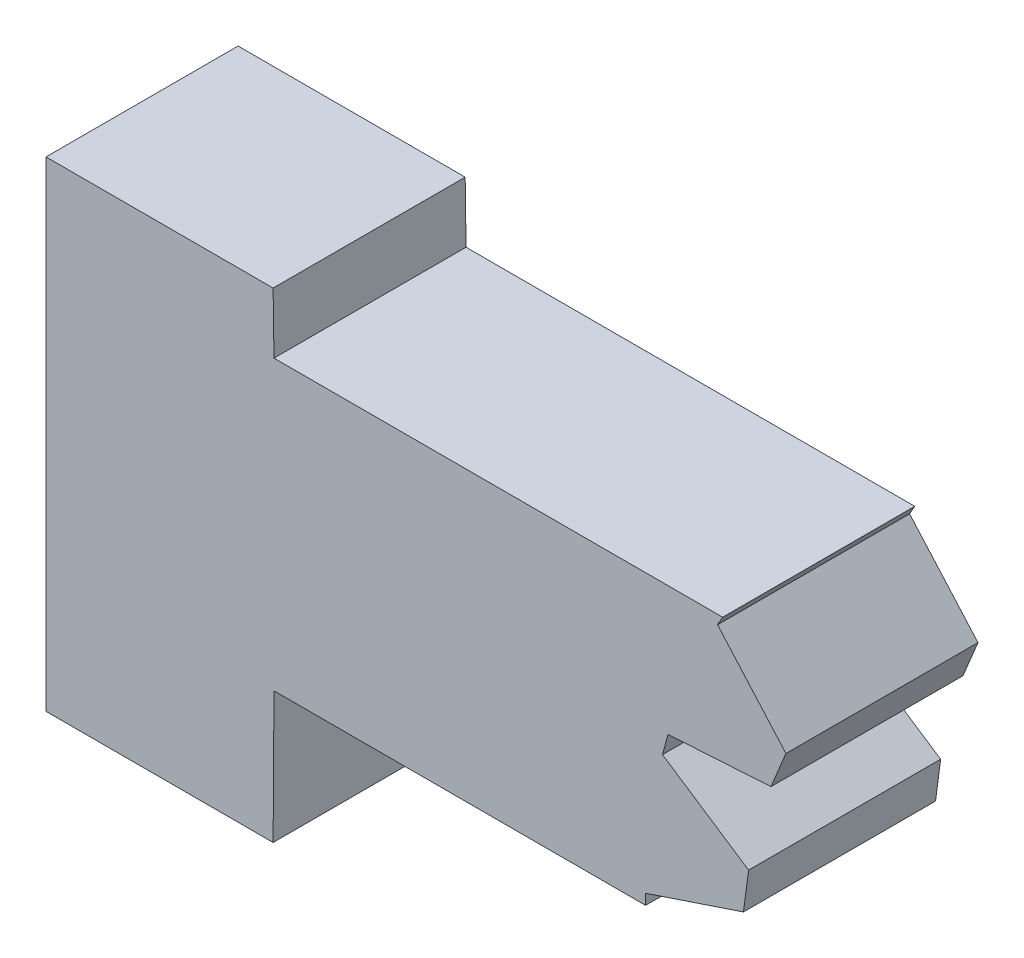
ISO-10303-21;
HEADER;
FILE_DESCRIPTION(('STEP AP214'),'2;1');
FILE_NAME('part.step','',(''),(''),'','','');
FILE_SCHEMA(('AUTOMOTIVE_DESIGN { 1 0 10303 214 1 1 1 1 }'));
ENDSEC;
DATA;
#1=APPLICATION_CONTEXT('core data for automotive mechanical design processes');
#2=APPLICATION_PROTOCOL_DEFINITION('international standard','automotive_design',2000,#1);
#3=PRODUCT_CONTEXT('',#1,'mechanical');
#4=PRODUCT('Part','Part','',(#3));
#5=PRODUCT_RELATED_PRODUCT_CATEGORY('part','',(#4));
#6=PRODUCT_DEFINITION_FORMATION('','',#4);
#7=PRODUCT_DEFINITION_CONTEXT('part definition',#1,'design');
#8=PRODUCT_DEFINITION('design','',#6,#7);
#9=PRODUCT_DEFINITION_SHAPE('','',#8);
#10=(LENGTH_UNIT() NAMED_UNIT(*) SI_UNIT(.MILLI.,.METRE.));
#11=(NAMED_UNIT(*) PLANE_ANGLE_UNIT() SI_UNIT($,.RADIAN.));
#12=(NAMED_UNIT(*) SI_UNIT($,.STERADIAN.) SOLID_ANGLE_UNIT());
#13=UNCERTAINTY_MEASURE_WITH_UNIT(LENGTH_MEASURE(1.E-05),#10,'distance_accuracy_value','');
#14=(GEOMETRIC_REPRESENTATION_CONTEXT(3) GLOBAL_UNCERTAINTY_ASSIGNED_CONTEXT((#13)) GLOBAL_UNIT_ASSIGNED_CONTEXT((#10,
#11,#12)) REPRESENTATION_CONTEXT('',''));
#15=CARTESIAN_POINT('',(0.,0.,0.));
#16=DIRECTION('',(0.,0.,1.));
#17=DIRECTION('',(1.,0.,0.));
#18=AXIS2_PLACEMENT_3D('',#15,#16,#17);
#19=CARTESIAN_POINT('',(13.9854605352733,8.55490384085248,4.));
#20=DIRECTION('',(-0.870533332407199,0.492109456491152,0.));
#21=DIRECTION('',(-0.492109456491152,-0.870533332407199,0.));
#22=AXIS2_PLACEMENT_3D('',#19,#20,#21);
#23=PLANE('',#22);
#24=DIRECTION('',(0.492109456491152,0.870533332407199,0.));
#25=VECTOR('',#24,1.);
#26=CARTESIAN_POINT('',(13.9854605352733,8.55490384085248,0.));
#27=LINE('',#26,#25);
#28=CARTESIAN_POINT('',(13.9854605352733,8.55490384085248,0.));
#29=VERTEX_POINT('',#28);
#30=CARTESIAN_POINT('',(14.0927837049311,8.74475671869166,0.));
#31=VERTEX_POINT('',#30);
#32=EDGE_CURVE('E179',#29,#31,#27,.T.);
#33=ORIENTED_EDGE('',*,*,#32,.T.);
#34=DIRECTION('',(0.,0.,-1.));
#35=VECTOR('',#34,1.);
#36=CARTESIAN_POINT('',(14.0927837049311,8.74475671869166,4.));
#37=LINE('',#36,#35);
#38=CARTESIAN_POINT('',(14.0927837049311,8.74475671869166,4.));
#39=VERTEX_POINT('',#38);
#40=EDGE_CURVE('E11',#39,#31,#37,.T.);
#41=ORIENTED_EDGE('',*,*,#40,.F.);
#42=DIRECTION('',(0.492109456491152,0.870533332407199,0.));
#43=VECTOR('',#42,1.);
#44=CARTESIAN_POINT('',(13.9854605352733,8.55490384085248,4.));
#45=LINE('',#44,#43);
#46=CARTESIAN_POINT('',(13.9854605352733,8.55490384085248,4.));
#47=VERTEX_POINT('',#46);
#48=EDGE_CURVE('E209',#47,#39,#45,.T.);
#49=ORIENTED_EDGE('',*,*,#48,.F.);
#50=DIRECTION('',(0.,0.,-1.));
#51=VECTOR('',#50,1.);
#52=CARTESIAN_POINT('',(13.9854605352733,8.55490384085248,4.));
#53=LINE('',#52,#51);
#54=EDGE_CURVE('E175',#47,#29,#53,.T.);
#55=ORIENTED_EDGE('',*,*,#54,.T.);
#56=EDGE_LOOP('',(#33,#41,#49,#55));
#57=FACE_BOUND('',#56,.T.);
#58=ADVANCED_FACE('F35',(#57),#23,.F.);
#59=CARTESIAN_POINT('',(4.74778370493112,8.74475671869166,4.));
#60=DIRECTION('',(0.,-1.,0.));
#61=DIRECTION('',(0.,0.,-1.));
#62=AXIS2_PLACEMENT_3D('',#59,#60,#61);
#63=PLANE('',#62);
#64=DIRECTION('',(-1.,0.,0.));
#65=VECTOR('',#64,1.);
#66=CARTESIAN_POINT('',(4.74778370493112,8.74475671869166,0.));
#67=LINE('',#66,#65);
#68=CARTESIAN_POINT('',(4.74778370493112,8.74475671869166,0.));
#69=VERTEX_POINT('',#68);
#70=EDGE_CURVE('E182',#31,#69,#67,.T.);
#71=ORIENTED_EDGE('',*,*,#70,.T.);
#72=DIRECTION('',(0.,0.,-1.));
#73=VECTOR('',#72,1.);
#74=CARTESIAN_POINT('',(4.74778370493112,8.74475671869166,4.));
#75=LINE('',#74,#73);
#76=CARTESIAN_POINT('',(4.74778370493112,8.74475671869166,4.));
#77=VERTEX_POINT('',#76);
#78=EDGE_CURVE('E43',#77,#69,#75,.T.);
#79=ORIENTED_EDGE('',*,*,#78,.F.);
#80=DIRECTION('',(-1.,0.,0.));
#81=VECTOR('',#80,1.);
#82=CARTESIAN_POINT('',(4.74778370493112,8.74475671869166,4.));
#83=LINE('',#82,#81);
#84=EDGE_CURVE('E118',#39,#77,#83,.T.);
#85=ORIENTED_EDGE('',*,*,#84,.F.);
#86=ORIENTED_EDGE('',*,*,#40,.T.);
#87=EDGE_LOOP('',(#71,#79,#85,#86));
#88=FACE_BOUND('',#87,.T.);
#89=ADVANCED_FACE('F307',(#88),#63,.F.);
#90=CARTESIAN_POINT('',(4.73,10.,4.));
#91=DIRECTION('',(-0.999899655561117,-0.01416611480819,0.));
#92=DIRECTION('',(0.01416611480819,-0.999899655561117,0.));
#93=AXIS2_PLACEMENT_3D('',#90,#91,#92);
#94=PLANE('',#93);
#95=DIRECTION('',(-0.01416611480819,0.999899655561117,0.));
#96=VECTOR('',#95,1.);
#97=CARTESIAN_POINT('',(4.73,10.,0.));
#98=LINE('',#97,#96);
#99=CARTESIAN_POINT('',(4.73,10.,0.));
#100=VERTEX_POINT('',#99);
#101=EDGE_CURVE('E184',#69,#100,#98,.T.);
#102=ORIENTED_EDGE('',*,*,#101,.T.);
#103=DIRECTION('',(0.,0.,-1.));
#104=VECTOR('',#103,1.);
#105=CARTESIAN_POINT('',(4.73,10.,4.));
#106=LINE('',#105,#104);
#107=CARTESIAN_POINT('',(4.73,10.,4.));
#108=VERTEX_POINT('',#107);
#109=EDGE_CURVE('E240',#108,#100,#106,.T.);
#110=ORIENTED_EDGE('',*,*,#109,.F.);
#111=DIRECTION('',(-0.01416611480819,0.999899655561117,0.));
#112=VECTOR('',#111,1.);
#113=CARTESIAN_POINT('',(4.73,10.,4.));
#114=LINE('',#113,#112);
#115=EDGE_CURVE('E248',#77,#108,#114,.T.);
#116=ORIENTED_EDGE('',*,*,#115,.F.);
#117=ORIENTED_EDGE('',*,*,#78,.T.);
#118=EDGE_LOOP('',(#102,#110,#116,#117));
#119=FACE_BOUND('',#118,.T.);
#120=ADVANCED_FACE('F246',(#119),#94,.F.);
#121=CARTESIAN_POINT('',(4.73,10.,4.));
#122=DIRECTION('',(0.,-1.,0.));
#123=DIRECTION('',(0.,0.,-1.));
#124=AXIS2_PLACEMENT_3D('',#121,#122,#123);
#125=PLANE('',#124);
#126=DIRECTION('',(-1.,0.,0.));
#127=VECTOR('',#126,1.);
#128=CARTESIAN_POINT('',(4.73,10.,0.));
#129=LINE('',#128,#127);
#130=CARTESIAN_POINT('',(0.,10.,0.));
#131=VERTEX_POINT('',#130);
#132=EDGE_CURVE('E186',#100,#131,#129,.T.);
#133=ORIENTED_EDGE('',*,*,#132,.T.);
#134=DIRECTION('',(0.,0.,-1.));
#135=VECTOR('',#134,1.);
#136=CARTESIAN_POINT('',(0.,10.,4.));
#137=LINE('',#136,#135);
#138=CARTESIAN_POINT('',(0.,10.,4.));
#139=VERTEX_POINT('',#138);
#140=EDGE_CURVE('E237',#139,#131,#137,.T.);
#141=ORIENTED_EDGE('',*,*,#140,.F.);
#142=DIRECTION('',(-1.,0.,0.));
#143=VECTOR('',#142,1.);
#144=CARTESIAN_POINT('',(4.73,10.,4.));
#145=LINE('',#144,#143);
#146=EDGE_CURVE('E266',#108,#139,#145,.T.);
#147=ORIENTED_EDGE('',*,*,#146,.F.);
#148=ORIENTED_EDGE('',*,*,#109,.T.);
#149=EDGE_LOOP('',(#133,#141,#147,#148));
#150=FACE_BOUND('',#149,.T.);
#151=ADVANCED_FACE('F257',(#150),#125,.F.);
#152=CARTESIAN_POINT('',(0.,0.,4.));
#153=DIRECTION('',(1.,0.,0.));
#154=DIRECTION('',(0.,0.,-1.));
#155=AXIS2_PLACEMENT_3D('',#152,#153,#154);
#156=PLANE('',#155);
#157=DIRECTION('',(0.,-1.,0.));
#158=VECTOR('',#157,1.);
#159=CARTESIAN_POINT('',(0.,0.,0.));
#160=LINE('',#159,#158);
#161=CARTESIAN_POINT('',(0.,0.,0.));
#162=VERTEX_POINT('',#161);
#163=EDGE_CURVE('E188',#131,#162,#160,.T.);
#164=ORIENTED_EDGE('',*,*,#163,.T.);
#165=DIRECTION('',(0.,0.,-1.));
#166=VECTOR('',#165,1.);
#167=CARTESIAN_POINT('',(0.,0.,4.));
#168=LINE('',#167,#166);
#169=CARTESIAN_POINT('',(0.,0.,4.));
#170=VERTEX_POINT('',#169);
#171=EDGE_CURVE('E234',#170,#162,#168,.T.);
#172=ORIENTED_EDGE('',*,*,#171,.F.);
#173=DIRECTION('',(0.,-1.,0.));
#174=VECTOR('',#173,1.);
#175=CARTESIAN_POINT('',(0.,0.,4.));
#176=LINE('',#175,#174);
#177=EDGE_CURVE('E263',#139,#170,#176,.T.);
#178=ORIENTED_EDGE('',*,*,#177,.F.);
#179=ORIENTED_EDGE('',*,*,#140,.T.);
#180=EDGE_LOOP('',(#164,#172,#178,#179));
#181=FACE_BOUND('',#180,.T.);
#182=ADVANCED_FACE('F261',(#181),#156,.F.);
#183=CARTESIAN_POINT('',(4.73,0.,4.));
#184=DIRECTION('',(0.,1.,0.));
#185=DIRECTION('',(0.,0.,1.));
#186=AXIS2_PLACEMENT_3D('',#183,#184,#185);
#187=PLANE('',#186);
#188=DIRECTION('',(1.,0.,0.));
#189=VECTOR('',#188,1.);
#190=CARTESIAN_POINT('',(4.73,0.,0.));
#191=LINE('',#190,#189);
#192=CARTESIAN_POINT('',(4.73,0.,0.));
#193=VERTEX_POINT('',#192);
#194=EDGE_CURVE('E190',#162,#193,#191,.T.);
#195=ORIENTED_EDGE('',*,*,#194,.T.);
#196=DIRECTION('',(0.,0.,-1.));
#197=VECTOR('',#196,1.);
#198=CARTESIAN_POINT('',(4.73,0.,4.));
#199=LINE('',#198,#197);
#200=CARTESIAN_POINT('',(4.73,0.,4.));
#201=VERTEX_POINT('',#200);
#202=EDGE_CURVE('E231',#201,#193,#199,.T.);
#203=ORIENTED_EDGE('',*,*,#202,.F.);
#204=DIRECTION('',(1.,0.,0.));
#205=VECTOR('',#204,1.);
#206=CARTESIAN_POINT('',(4.73,0.,4.));
#207=LINE('',#206,#205);
#208=EDGE_CURVE('E265',#170,#201,#207,.T.);
#209=ORIENTED_EDGE('',*,*,#208,.F.);
#210=ORIENTED_EDGE('',*,*,#171,.T.);
#211=EDGE_LOOP('',(#195,#203,#209,#210));
#212=FACE_BOUND('',#211,.T.);
#213=ADVANCED_FACE('F320',(#212),#187,.F.);
#214=CARTESIAN_POINT('',(4.74778370493112,2.74476455823996,4.));
#215=DIRECTION('',(-0.999979011054282,0.00647900076402233,0.));
#216=DIRECTION('',(-0.00647900076402233,-0.999979011054282,0.));
#217=AXIS2_PLACEMENT_3D('',#214,#215,#216);
#218=PLANE('',#217);
#219=DIRECTION('',(0.00647900076402233,0.999979011054282,0.));
#220=VECTOR('',#219,1.);
#221=CARTESIAN_POINT('',(4.74778370493112,2.74476455823996,0.));
#222=LINE('',#221,#220);
#223=CARTESIAN_POINT('',(4.74778370493112,2.74476455823996,0.));
#224=VERTEX_POINT('',#223);
#225=EDGE_CURVE('E192',#193,#224,#222,.T.);
#226=ORIENTED_EDGE('',*,*,#225,.T.);
#227=DIRECTION('',(0.,0.,-1.));
#228=VECTOR('',#227,1.);
#229=CARTESIAN_POINT('',(4.74778370493112,2.74476455823996,4.));
#230=LINE('',#229,#228);
#231=CARTESIAN_POINT('',(4.74778370493112,2.74476455823996,4.));
#232=VERTEX_POINT('',#231);
#233=EDGE_CURVE('E228',#232,#224,#230,.T.);
#234=ORIENTED_EDGE('',*,*,#233,.F.);
#235=DIRECTION('',(0.00647900076402233,0.999979011054282,0.));
#236=VECTOR('',#235,1.);
#237=CARTESIAN_POINT('',(4.74778370493112,2.74476455823996,4.));
#238=LINE('',#237,#236);
#239=EDGE_CURVE('E268',#201,#232,#238,.T.);
#240=ORIENTED_EDGE('',*,*,#239,.F.);
#241=ORIENTED_EDGE('',*,*,#202,.T.);
#242=EDGE_LOOP('',(#226,#234,#240,#241));
#243=FACE_BOUND('',#242,.T.);
#244=ADVANCED_FACE('F323',(#243),#218,.F.);
#245=CARTESIAN_POINT('',(4.74778370493112,2.74476455823996,4.));
#246=DIRECTION('',(0.,1.,0.));
#247=DIRECTION('',(0.,0.,1.));
#248=AXIS2_PLACEMENT_3D('',#245,#246,#247);
#249=PLANE('',#248);
#250=DIRECTION('',(1.,0.,0.));
#251=VECTOR('',#250,1.);
#252=CARTESIAN_POINT('',(4.74778370493112,2.74476455823996,0.));
#253=LINE('',#252,#251);
#254=CARTESIAN_POINT('',(12.4870749114308,2.74476455823996,0.));
#255=VERTEX_POINT('',#254);
#256=EDGE_CURVE('E194',#224,#255,#253,.T.);
#257=ORIENTED_EDGE('',*,*,#256,.T.);
#258=DIRECTION('',(0.,0.,-1.));
#259=VECTOR('',#258,1.);
#260=CARTESIAN_POINT('',(12.4870749114308,2.74476455823996,4.));
#261=LINE('',#260,#259);
#262=CARTESIAN_POINT('',(12.4870749114308,2.74476455823996,4.));
#263=VERTEX_POINT('',#262);
#264=EDGE_CURVE('E225',#263,#255,#261,.T.);
#265=ORIENTED_EDGE('',*,*,#264,.F.);
#266=DIRECTION('',(1.,0.,0.));
#267=VECTOR('',#266,1.);
#268=CARTESIAN_POINT('',(4.74778370493112,2.74476455823996,4.));
#269=LINE('',#268,#267);
#270=EDGE_CURVE('E274',#232,#263,#269,.T.);
#271=ORIENTED_EDGE('',*,*,#270,.F.);
#272=ORIENTED_EDGE('',*,*,#233,.T.);
#273=EDGE_LOOP('',(#257,#265,#271,#272));
#274=FACE_BOUND('',#273,.T.);
#275=ADVANCED_FACE('F327',(#274),#249,.F.);
#276=CARTESIAN_POINT('',(12.4870749114308,2.74476455823996,4.));
#277=DIRECTION('',(-1.,0.,0.));
#278=DIRECTION('',(0.,0.,1.));
#279=AXIS2_PLACEMENT_3D('',#276,#277,#278);
#280=PLANE('',#279);
#281=DIRECTION('',(0.,1.,0.));
#282=VECTOR('',#281,1.);
#283=CARTESIAN_POINT('',(12.4870749114308,2.74476455823996,0.));
#284=LINE('',#283,#282);
#285=CARTESIAN_POINT('',(12.4870749114308,2.96285256334162,0.));
#286=VERTEX_POINT('',#285);
#287=EDGE_CURVE('E196',#255,#286,#284,.T.);
#288=ORIENTED_EDGE('',*,*,#287,.T.);
#289=DIRECTION('',(0.,0.,-1.));
#290=VECTOR('',#289,1.);
#291=CARTESIAN_POINT('',(12.4870749114308,2.96285256334162,4.));
#292=LINE('',#291,#290);
#293=CARTESIAN_POINT('',(12.4870749114308,2.96285256334162,4.));
#294=VERTEX_POINT('',#293);
#295=EDGE_CURVE('E222',#294,#286,#292,.T.);
#296=ORIENTED_EDGE('',*,*,#295,.F.);
#297=DIRECTION('',(0.,1.,0.));
#298=VECTOR('',#297,1.);
#299=CARTESIAN_POINT('',(12.4870749114308,2.74476455823996,4.));
#300=LINE('',#299,#298);
#301=EDGE_CURVE('E276',#263,#294,#300,.T.);
#302=ORIENTED_EDGE('',*,*,#301,.F.);
#303=ORIENTED_EDGE('',*,*,#264,.T.);
#304=EDGE_LOOP('',(#288,#296,#302,#303));
#305=FACE_BOUND('',#304,.T.);
#306=ADVANCED_FACE('F331',(#305),#280,.F.);
#307=CARTESIAN_POINT('',(12.4870749114308,2.96285256334162,4.));
#308=DIRECTION('',(-0.31722342524605,0.948350830903397,0.));
#309=DIRECTION('',(-0.948350830903397,-0.31722342524605,0.));
#310=AXIS2_PLACEMENT_3D('',#307,#308,#309);
#311=PLANE('',#310);
#312=DIRECTION('',(0.948350830903397,0.31722342524605,0.));
#313=VECTOR('',#312,1.);
#314=CARTESIAN_POINT('',(12.4870749114308,2.96285256334162,0.));
#315=LINE('',#314,#313);
#316=CARTESIAN_POINT('',(14.5256753283553,3.64476455823994,0.));
#317=VERTEX_POINT('',#316);
#318=EDGE_CURVE('E198',#286,#317,#315,.T.);
#319=ORIENTED_EDGE('',*,*,#318,.T.);
#320=DIRECTION('',(0.,0.,-1.));
#321=VECTOR('',#320,1.);
#322=CARTESIAN_POINT('',(14.5256753283553,3.64476455823994,4.));
#323=LINE('',#322,#321);
#324=CARTESIAN_POINT('',(14.5256753283553,3.64476455823994,4.));
#325=VERTEX_POINT('',#324);
#326=EDGE_CURVE('E219',#325,#317,#323,.T.);
#327=ORIENTED_EDGE('',*,*,#326,.F.);
#328=DIRECTION('',(0.948350830903397,0.31722342524605,0.));
#329=VECTOR('',#328,1.);
#330=CARTESIAN_POINT('',(12.4870749114308,2.96285256334162,4.));
#331=LINE('',#330,#329);
#332=EDGE_CURVE('E278',#294,#325,#331,.T.);
#333=ORIENTED_EDGE('',*,*,#332,.F.);
#334=ORIENTED_EDGE('',*,*,#295,.T.);
#335=EDGE_LOOP('',(#319,#327,#333,#334));
#336=FACE_BOUND('',#335,.T.);
#337=ADVANCED_FACE('F335',(#336),#311,.F.);
#338=CARTESIAN_POINT('',(14.5256753283553,3.64476455823994,4.));
#339=DIRECTION('',(-0.991444861373811,0.130526192220048,0.));
#340=DIRECTION('',(-0.130526192220048,-0.991444861373811,0.));
#341=AXIS2_PLACEMENT_3D('',#338,#339,#340);
#342=PLANE('',#341);
#343=DIRECTION('',(0.130526192220048,0.991444861373811,0.));
#344=VECTOR('',#343,1.);
#345=CARTESIAN_POINT('',(14.5256753283553,3.64476455823994,0.));
#346=LINE('',#345,#344);
#347=CARTESIAN_POINT('',(14.6320971149535,4.45311828147681,0.));
#348=VERTEX_POINT('',#347);
#349=EDGE_CURVE('E200',#317,#348,#346,.T.);
#350=ORIENTED_EDGE('',*,*,#349,.T.);
#351=DIRECTION('',(0.,0.,-1.));
#352=VECTOR('',#351,1.);
#353=CARTESIAN_POINT('',(14.6320971149535,4.45311828147681,4.));
#354=LINE('',#353,#352);
#355=CARTESIAN_POINT('',(14.6320971149535,4.45311828147681,4.));
#356=VERTEX_POINT('',#355);
#357=EDGE_CURVE('E216',#356,#348,#354,.T.);
#358=ORIENTED_EDGE('',*,*,#357,.F.);
#359=DIRECTION('',(0.130526192220048,0.991444861373811,0.));
#360=VECTOR('',#359,1.);
#361=CARTESIAN_POINT('',(14.5256753283553,3.64476455823994,4.));
#362=LINE('',#361,#360);
#363=EDGE_CURVE('E280',#325,#356,#362,.T.);
#364=ORIENTED_EDGE('',*,*,#363,.F.);
#365=ORIENTED_EDGE('',*,*,#326,.T.);
#366=EDGE_LOOP('',(#350,#358,#364,#365));
#367=FACE_BOUND('',#366,.T.);
#368=ADVANCED_FACE('F339',(#367),#342,.F.);
#369=CARTESIAN_POINT('',(14.6320971149535,4.45311828147681,4.));
#370=DIRECTION('',(-0.551865555625634,-0.833933095945958,0.));
#371=DIRECTION('',(0.833933095945958,-0.551865555625634,0.));
#372=AXIS2_PLACEMENT_3D('',#369,#370,#371);
#373=PLANE('',#372);
#374=DIRECTION('',(-0.833933095945958,0.551865555625634,0.));
#375=VECTOR('',#374,1.);
#376=CARTESIAN_POINT('',(14.6320971149535,4.45311828147681,0.));
#377=LINE('',#376,#375);
#378=CARTESIAN_POINT('',(12.839452134126,5.63942330185938,0.));
#379=VERTEX_POINT('',#378);
#380=EDGE_CURVE('E202',#348,#379,#377,.T.);
#381=ORIENTED_EDGE('',*,*,#380,.T.);
#382=DIRECTION('',(0.,0.,-1.));
#383=VECTOR('',#382,1.);
#384=CARTESIAN_POINT('',(12.839452134126,5.63942330185938,4.));
#385=LINE('',#384,#383);
#386=CARTESIAN_POINT('',(12.839452134126,5.63942330185938,4.));
#387=VERTEX_POINT('',#386);
#388=EDGE_CURVE('E213',#387,#379,#385,.T.);
#389=ORIENTED_EDGE('',*,*,#388,.F.);
#390=DIRECTION('',(-0.833933095945958,0.551865555625634,0.));
#391=VECTOR('',#390,1.);
#392=CARTESIAN_POINT('',(14.6320971149535,4.45311828147681,4.));
#393=LINE('',#392,#391);
#394=EDGE_CURVE('E282',#356,#387,#393,.T.);
#395=ORIENTED_EDGE('',*,*,#394,.F.);
#396=ORIENTED_EDGE('',*,*,#357,.T.);
#397=EDGE_LOOP('',(#381,#389,#395,#396));
#398=FACE_BOUND('',#397,.T.);
#399=ADVANCED_FACE('F288',(#398),#373,.F.);
#400=CARTESIAN_POINT('',(12.839452134126,5.63942330185938,4.));
#401=DIRECTION('',(-0.965925826289063,0.258819045102539,0.));
#402=DIRECTION('',(-0.258819045102539,-0.965925826289063,0.));
#403=AXIS2_PLACEMENT_3D('',#400,#401,#402);
#404=PLANE('',#403);
#405=DIRECTION('',(0.258819045102539,0.965925826289064,0.));
#406=VECTOR('',#405,1.);
#407=CARTESIAN_POINT('',(12.839452134126,5.63942330185938,0.));
#408=LINE('',#407,#406);
#409=CARTESIAN_POINT('',(12.9523427925835,6.06073697492256,0.));
#410=VERTEX_POINT('',#409);
#411=EDGE_CURVE('E204',#379,#410,#408,.T.);
#412=ORIENTED_EDGE('',*,*,#411,.T.);
#413=DIRECTION('',(0.,0.,-1.));
#414=VECTOR('',#413,1.);
#415=CARTESIAN_POINT('',(12.9523427925835,6.06073697492256,4.));
#416=LINE('',#415,#414);
#417=CARTESIAN_POINT('',(12.9523427925835,6.06073697492256,4.));
#418=VERTEX_POINT('',#417);
#419=EDGE_CURVE('E170',#418,#410,#416,.T.);
#420=ORIENTED_EDGE('',*,*,#419,.F.);
#421=DIRECTION('',(0.258819045102539,0.965925826289064,0.));
#422=VECTOR('',#421,1.);
#423=CARTESIAN_POINT('',(12.839452134126,5.63942330185938,4.));
#424=LINE('',#423,#422);
#425=EDGE_CURVE('E161',#387,#418,#424,.T.);
#426=ORIENTED_EDGE('',*,*,#425,.F.);
#427=ORIENTED_EDGE('',*,*,#388,.T.);
#428=EDGE_LOOP('',(#412,#420,#426,#427));
#429=FACE_BOUND('',#428,.T.);
#430=ADVANCED_FACE('F292',(#429),#404,.F.);
#431=CARTESIAN_POINT('',(12.9523427925835,6.06073697492256,4.));
#432=DIRECTION('',(-0.060963042672375,0.998140023958626,0.));
#433=DIRECTION('',(-0.998140023958626,-0.060963042672375,0.));
#434=AXIS2_PLACEMENT_3D('',#431,#432,#433);
#435=PLANE('',#434);
#436=DIRECTION('',(0.998140023958626,0.060963042672375,0.));
#437=VECTOR('',#436,1.);
#438=CARTESIAN_POINT('',(12.9523427925835,6.06073697492256,0.));
#439=LINE('',#438,#437);
#440=CARTESIAN_POINT('',(15.0979713961381,6.19178476879701,0.));
#441=VERTEX_POINT('',#440);
#442=EDGE_CURVE('E169',#410,#441,#439,.T.);
#443=ORIENTED_EDGE('',*,*,#442,.T.);
#444=DIRECTION('',(0.,0.,-1.));
#445=VECTOR('',#444,1.);
#446=CARTESIAN_POINT('',(15.0979713961381,6.19178476879701,4.));
#447=LINE('',#446,#445);
#448=CARTESIAN_POINT('',(15.0979713961381,6.19178476879701,4.));
#449=VERTEX_POINT('',#448);
#450=EDGE_CURVE('E166',#449,#441,#447,.T.);
#451=ORIENTED_EDGE('',*,*,#450,.F.);
#452=DIRECTION('',(0.998140023958626,0.060963042672375,0.));
#453=VECTOR('',#452,1.);
#454=CARTESIAN_POINT('',(12.9523427925835,6.06073697492256,4.));
#455=LINE('',#454,#453);
#456=EDGE_CURVE('E155',#418,#449,#455,.T.);
#457=ORIENTED_EDGE('',*,*,#456,.F.);
#458=ORIENTED_EDGE('',*,*,#419,.T.);
#459=EDGE_LOOP('',(#443,#451,#457,#458));
#460=FACE_BOUND('',#459,.T.);
#461=ADVANCED_FACE('F167',(#460),#435,.F.);
#462=CARTESIAN_POINT('',(15.0979713961381,6.19178476879701,4.));
#463=DIRECTION('',(-0.923879532511289,0.382683432365085,0.));
#464=DIRECTION('',(-0.382683432365085,-0.923879532511289,0.));
#465=AXIS2_PLACEMENT_3D('',#462,#463,#464);
#466=PLANE('',#465);
#467=DIRECTION('',(0.382683432365085,0.923879532511289,0.));
#468=VECTOR('',#467,1.);
#469=CARTESIAN_POINT('',(15.0979713961381,6.19178476879701,0.));
#470=LINE('',#469,#468);
#471=CARTESIAN_POINT('',(15.4099842870463,6.94505052166298,0.));
#472=VERTEX_POINT('',#471);
#473=EDGE_CURVE('E104',#441,#472,#470,.T.);
#474=ORIENTED_EDGE('',*,*,#473,.T.);
#475=DIRECTION('',(0.,0.,-1.));
#476=VECTOR('',#475,1.);
#477=CARTESIAN_POINT('',(15.4099842870463,6.94505052166298,4.));
#478=LINE('',#477,#476);
#479=CARTESIAN_POINT('',(15.4099842870463,6.94505052166298,4.));
#480=VERTEX_POINT('',#479);
#481=EDGE_CURVE('E171',#480,#472,#478,.T.);
#482=ORIENTED_EDGE('',*,*,#481,.F.);
#483=DIRECTION('',(0.382683432365085,0.923879532511289,0.));
#484=VECTOR('',#483,1.);
#485=CARTESIAN_POINT('',(15.0979713961381,6.19178476879701,4.));
#486=LINE('',#485,#484);
#487=EDGE_CURVE('E159',#449,#480,#486,.T.);
#488=ORIENTED_EDGE('',*,*,#487,.F.);
#489=ORIENTED_EDGE('',*,*,#450,.T.);
#490=EDGE_LOOP('',(#474,#482,#488,#489));
#491=FACE_BOUND('',#490,.T.);
#492=ADVANCED_FACE('F173',(#491),#466,.F.);
#493=CARTESIAN_POINT('',(15.4099842870463,6.94505052166298,4.));
#494=DIRECTION('',(-0.748898960390284,-0.662684198639407,0.));
#495=DIRECTION('',(0.662684198639407,-0.748898960390284,0.));
#496=AXIS2_PLACEMENT_3D('',#493,#494,#495);
#497=PLANE('',#496);
#498=DIRECTION('',(-0.662684198639407,0.748898960390284,0.));
#499=VECTOR('',#498,1.);
#500=CARTESIAN_POINT('',(15.4099842870463,6.94505052166298,0.));
#501=LINE('',#500,#499);
#502=EDGE_CURVE('E110',#472,#29,#501,.T.);
#503=ORIENTED_EDGE('',*,*,#502,.T.);
#504=ORIENTED_EDGE('',*,*,#54,.F.);
#505=DIRECTION('',(-0.662684198639407,0.748898960390284,0.));
#506=VECTOR('',#505,1.);
#507=CARTESIAN_POINT('',(15.4099842870463,6.94505052166298,4.));
#508=LINE('',#507,#506);
#509=EDGE_CURVE('E51',#480,#47,#508,.T.);
#510=ORIENTED_EDGE('',*,*,#509,.F.);
#511=ORIENTED_EDGE('',*,*,#481,.T.);
#512=EDGE_LOOP('',(#503,#504,#510,#511));
#513=FACE_BOUND('',#512,.T.);
#514=ADVANCED_FACE('F296',(#513),#497,.F.);
#515=CARTESIAN_POINT('',(0.,0.,4.));
#516=DIRECTION('',(0.,0.,1.));
#517=DIRECTION('',(1.,0.,0.));
#518=AXIS2_PLACEMENT_3D('',#515,#516,#517);
#519=PLANE('',#518);
#520=ORIENTED_EDGE('',*,*,#48,.T.);
#521=ORIENTED_EDGE('',*,*,#84,.T.);
#522=ORIENTED_EDGE('',*,*,#115,.T.);
#523=ORIENTED_EDGE('',*,*,#146,.T.);
#524=ORIENTED_EDGE('',*,*,#177,.T.);
#525=ORIENTED_EDGE('',*,*,#208,.T.);
#526=ORIENTED_EDGE('',*,*,#239,.T.);
#527=ORIENTED_EDGE('',*,*,#270,.T.);
#528=ORIENTED_EDGE('',*,*,#301,.T.);
#529=ORIENTED_EDGE('',*,*,#332,.T.);
#530=ORIENTED_EDGE('',*,*,#363,.T.);
#531=ORIENTED_EDGE('',*,*,#394,.T.);
#532=ORIENTED_EDGE('',*,*,#425,.T.);
#533=ORIENTED_EDGE('',*,*,#456,.T.);
#534=ORIENTED_EDGE('',*,*,#487,.T.);
#535=ORIENTED_EDGE('',*,*,#509,.T.);
#536=EDGE_LOOP('',(#520,#521,#522,#523,#524,#525,#526,#527,#528,#529,#530,#531,#532,#533,#534,#535));
#537=FACE_BOUND('',#536,.T.);
#538=ADVANCED_FACE('F157',(#537),#519,.T.);
#539=CARTESIAN_POINT('',(0.,0.,0.));
#540=DIRECTION('',(0.,0.,1.));
#541=DIRECTION('',(1.,0.,0.));
#542=AXIS2_PLACEMENT_3D('',#539,#540,#541);
#543=PLANE('',#542);
#544=ORIENTED_EDGE('',*,*,#32,.F.);
#545=ORIENTED_EDGE('',*,*,#502,.F.);
#546=ORIENTED_EDGE('',*,*,#473,.F.);
#547=ORIENTED_EDGE('',*,*,#442,.F.);
#548=ORIENTED_EDGE('',*,*,#411,.F.);
#549=ORIENTED_EDGE('',*,*,#380,.F.);
#550=ORIENTED_EDGE('',*,*,#349,.F.);
#551=ORIENTED_EDGE('',*,*,#318,.F.);
#552=ORIENTED_EDGE('',*,*,#287,.F.);
#553=ORIENTED_EDGE('',*,*,#256,.F.);
#554=ORIENTED_EDGE('',*,*,#225,.F.);
#555=ORIENTED_EDGE('',*,*,#194,.F.);
#556=ORIENTED_EDGE('',*,*,#163,.F.);
#557=ORIENTED_EDGE('',*,*,#132,.F.);
#558=ORIENTED_EDGE('',*,*,#101,.F.);
#559=ORIENTED_EDGE('',*,*,#70,.F.);
#560=EDGE_LOOP('',(#544,#545,#546,#547,#548,#549,#550,#551,#552,#553,#554,#555,#556,#557,#558,#559));
#561=FACE_BOUND('',#560,.T.);
#562=ADVANCED_FACE('F252',(#561),#543,.F.);
#563=CLOSED_SHELL('',(#58,#89,#120,#151,#182,#213,#244,#275,#306,#337,#368,#399,#430,#461,#492,
#514,#538,#562));
#564=MANIFOLD_SOLID_BREP('B2',#563);
#565=ADVANCED_BREP_SHAPE_REPRESENTATION('',(#18,#564),#14);
#566=SHAPE_DEFINITION_REPRESENTATION(#9,#565);
ENDSEC;
END-ISO-10303-21;
